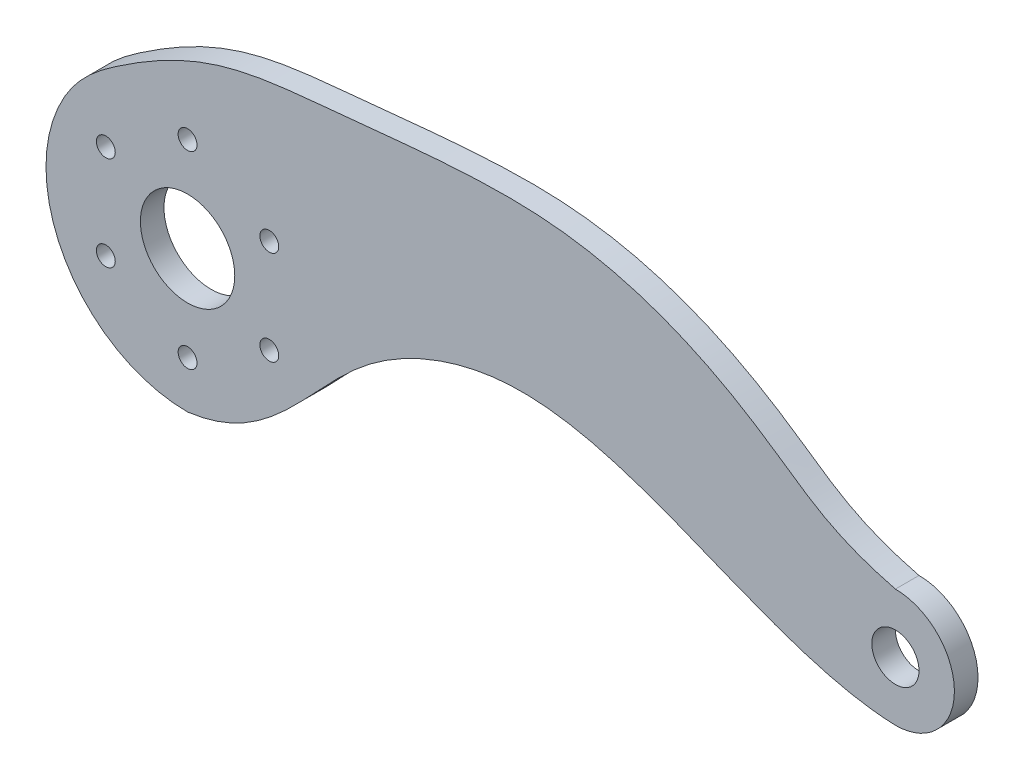
ISO-10303-21;
HEADER;
FILE_DESCRIPTION(('STEP AP214'),'2;1');
FILE_NAME('part.step','',(''),(''),'','','');
FILE_SCHEMA(('AUTOMOTIVE_DESIGN { 1 0 10303 214 1 1 1 1 }'));
ENDSEC;
DATA;
#1=APPLICATION_CONTEXT('core data for automotive mechanical design processes');
#2=APPLICATION_PROTOCOL_DEFINITION('international standard','automotive_design',2000,#1);
#3=PRODUCT_CONTEXT('',#1,'mechanical');
#4=PRODUCT('Part','Part','',(#3));
#5=PRODUCT_RELATED_PRODUCT_CATEGORY('part','',(#4));
#6=PRODUCT_DEFINITION_FORMATION('','',#4);
#7=PRODUCT_DEFINITION_CONTEXT('part definition',#1,'design');
#8=PRODUCT_DEFINITION('design','',#6,#7);
#9=PRODUCT_DEFINITION_SHAPE('','',#8);
#10=(LENGTH_UNIT() NAMED_UNIT(*) SI_UNIT(.MILLI.,.METRE.));
#11=(NAMED_UNIT(*) PLANE_ANGLE_UNIT() SI_UNIT($,.RADIAN.));
#12=(NAMED_UNIT(*) SI_UNIT($,.STERADIAN.) SOLID_ANGLE_UNIT());
#13=UNCERTAINTY_MEASURE_WITH_UNIT(LENGTH_MEASURE(1.E-05),#10,'distance_accuracy_value','');
#14=(GEOMETRIC_REPRESENTATION_CONTEXT(3) GLOBAL_UNCERTAINTY_ASSIGNED_CONTEXT((#13)) GLOBAL_UNIT_ASSIGNED_CONTEXT((#10,
#11,#12)) REPRESENTATION_CONTEXT('',''));
#15=CARTESIAN_POINT('',(0.,0.,0.));
#16=DIRECTION('',(0.,0.,1.));
#17=DIRECTION('',(1.,0.,0.));
#18=AXIS2_PLACEMENT_3D('',#15,#16,#17);
#19=CARTESIAN_POINT('',(150.,0.,5.));
#20=DIRECTION('',(0.,0.,-1.));
#21=DIRECTION('',(-1.,0.,0.));
#22=AXIS2_PLACEMENT_3D('',#19,#20,#21);
#23=CYLINDRICAL_SURFACE('',#22,12.5);
#24=CARTESIAN_POINT('',(150.,0.,0.));
#25=DIRECTION('',(0.,0.,1.));
#26=DIRECTION('',(1.,0.,0.));
#27=AXIS2_PLACEMENT_3D('',#24,#25,#26);
#28=CIRCLE('',#27,12.5);
#29=CARTESIAN_POINT('',(159.428456141883,-8.2069613609783,0.));
#30=VERTEX_POINT('',#29);
#31=CARTESIAN_POINT('',(150.,12.5,0.));
#32=VERTEX_POINT('',#31);
#33=EDGE_CURVE('E171',#30,#32,#28,.T.);
#34=ORIENTED_EDGE('',*,*,#33,.T.);
#35=DIRECTION('',(0.,0.,-1.));
#36=VECTOR('',#35,1.);
#37=CARTESIAN_POINT('',(150.,12.5,5.));
#38=LINE('',#37,#36);
#39=CARTESIAN_POINT('',(150.,12.5,5.));
#40=VERTEX_POINT('',#39);
#41=EDGE_CURVE('E11',#40,#32,#38,.T.);
#42=ORIENTED_EDGE('',*,*,#41,.F.);
#43=CARTESIAN_POINT('',(150.,0.,5.));
#44=DIRECTION('',(0.,0.,1.));
#45=DIRECTION('',(1.,0.,0.));
#46=AXIS2_PLACEMENT_3D('',#43,#44,#45);
#47=CIRCLE('',#46,12.5);
#48=CARTESIAN_POINT('',(159.428456141883,-8.2069613609783,5.));
#49=VERTEX_POINT('',#48);
#50=EDGE_CURVE('E87',#49,#40,#47,.T.);
#51=ORIENTED_EDGE('',*,*,#50,.F.);
#52=DIRECTION('',(0.,0.,-1.));
#53=VECTOR('',#52,1.);
#54=CARTESIAN_POINT('',(159.428456141883,-8.2069613609783,5.));
#55=LINE('',#54,#53);
#56=EDGE_CURVE('E152',#49,#30,#55,.T.);
#57=ORIENTED_EDGE('',*,*,#56,.T.);
#58=EDGE_LOOP('',(#34,#42,#51,#57));
#59=FACE_BOUND('',#58,.T.);
#60=ADVANCED_FACE('F36',(#59),#23,.T.);
#61=CARTESIAN_POINT('',(-26.0634616612886,14.8558394656963,5.));
#62=CARTESIAN_POINT('',(-22.9952074946197,20.2388624193786,5.));
#63=CARTESIAN_POINT('',(2.37328640151584,39.108047074936,5.));
#64=CARTESIAN_POINT('',(20.1597515349127,39.1077374338959,5.));
#65=CARTESIAN_POINT('',(86.7416157626449,46.9998153067509,5.));
#66=CARTESIAN_POINT('',(125.812924925436,25.830072721874,5.));
#67=CARTESIAN_POINT('',(135.882657692138,16.0754827587227,5.));
#68=CARTESIAN_POINT('',(150.,12.5,5.));
#69=B_SPLINE_CURVE_WITH_KNOTS('',3,(#61,#62,#63,#64,#65,#66,#67,#68),.UNSPECIFIED.,.F.,.F.,(4,1,
1,1,1,4),(0.,0.056043778506057,0.324796612619319,0.474987683898155,0.725167046493458,
0.945335070860267),.UNSPECIFIED.);
#70=DIRECTION('',(0.,0.,-1.));
#71=VECTOR('',#70,1.);
#72=SURFACE_OF_LINEAR_EXTRUSION('',#69,#71);
#73=CARTESIAN_POINT('',(-26.0634616612886,14.8558394656963,0.));
#74=CARTESIAN_POINT('',(-22.9952074946197,20.2388624193786,0.));
#75=CARTESIAN_POINT('',(2.37328640151584,39.108047074936,0.));
#76=CARTESIAN_POINT('',(20.1597515349127,39.1077374338959,0.));
#77=CARTESIAN_POINT('',(86.7416157626449,46.9998153067509,0.));
#78=CARTESIAN_POINT('',(125.812924925436,25.830072721874,0.));
#79=CARTESIAN_POINT('',(135.882657692138,16.0754827587227,0.));
#80=CARTESIAN_POINT('',(150.,12.5,0.));
#81=B_SPLINE_CURVE_WITH_KNOTS('',3,(#73,#74,#75,#76,#77,#78,#79,#80),.UNSPECIFIED.,.F.,.F.,(4,1,
1,1,1,4),(0.,0.056043778506057,0.324796612619319,0.474987683898155,0.725167046493458,
0.945335070860267),.UNSPECIFIED.);
#82=CARTESIAN_POINT('',(-26.0634616612886,14.8558394656963,0.));
#83=VERTEX_POINT('',#82);
#84=EDGE_CURVE('E167',#83,#32,#81,.T.);
#85=ORIENTED_EDGE('',*,*,#84,.F.);
#86=DIRECTION('',(0.,0.,-1.));
#87=VECTOR('',#86,1.);
#88=CARTESIAN_POINT('',(-26.0634616612886,14.8558394656963,5.));
#89=LINE('',#88,#87);
#90=CARTESIAN_POINT('',(-26.0634616612886,14.8558394656963,5.));
#91=VERTEX_POINT('',#90);
#92=EDGE_CURVE('E45',#91,#83,#89,.T.);
#93=ORIENTED_EDGE('',*,*,#92,.F.);
#94=EDGE_CURVE('E121',#91,#40,#69,.T.);
#95=ORIENTED_EDGE('',*,*,#94,.T.);
#96=ORIENTED_EDGE('',*,*,#41,.T.);
#97=EDGE_LOOP('',(#85,#93,#95,#96));
#98=FACE_BOUND('',#97,.T.);
#99=ADVANCED_FACE('F169',(#98),#72,.T.);
#100=CARTESIAN_POINT('',(0.,0.,5.));
#101=DIRECTION('',(0.,0.,-1.));
#102=DIRECTION('',(-1.,0.,0.));
#103=AXIS2_PLACEMENT_3D('',#100,#101,#102);
#104=CYLINDRICAL_SURFACE('',#103,30.);
#105=CARTESIAN_POINT('',(0.,0.,0.));
#106=DIRECTION('',(0.,0.,1.));
#107=DIRECTION('',(1.,0.,0.));
#108=AXIS2_PLACEMENT_3D('',#105,#106,#107);
#109=CIRCLE('',#108,30.);
#110=CARTESIAN_POINT('',(0.,-30.,0.));
#111=VERTEX_POINT('',#110);
#112=EDGE_CURVE('E159',#83,#111,#109,.T.);
#113=ORIENTED_EDGE('',*,*,#112,.T.);
#114=DIRECTION('',(0.,0.,-1.));
#115=VECTOR('',#114,1.);
#116=CARTESIAN_POINT('',(0.,-30.,5.));
#117=LINE('',#116,#115);
#118=CARTESIAN_POINT('',(0.,-30.,5.));
#119=VERTEX_POINT('',#118);
#120=EDGE_CURVE('E112',#119,#111,#117,.T.);
#121=ORIENTED_EDGE('',*,*,#120,.F.);
#122=CARTESIAN_POINT('',(0.,0.,5.));
#123=DIRECTION('',(0.,0.,1.));
#124=DIRECTION('',(1.,0.,0.));
#125=AXIS2_PLACEMENT_3D('',#122,#123,#124);
#126=CIRCLE('',#125,30.);
#127=EDGE_CURVE('E103',#91,#119,#126,.T.);
#128=ORIENTED_EDGE('',*,*,#127,.F.);
#129=ORIENTED_EDGE('',*,*,#92,.T.);
#130=EDGE_LOOP('',(#113,#121,#128,#129));
#131=FACE_BOUND('',#130,.T.);
#132=ADVANCED_FACE('F158',(#131),#104,.T.);
#133=CARTESIAN_POINT('',(0.,-30.,5.));
#134=CARTESIAN_POINT('',(17.9367533899456,-27.7458951634713,5.));
#135=CARTESIAN_POINT('',(30.1701670762407,-2.35203179127826,5.));
#136=CARTESIAN_POINT('',(85.2158700652859,19.6119948147056,5.));
#137=CARTESIAN_POINT('',(122.199362380188,-11.5342342503251,5.));
#138=CARTESIAN_POINT('',(150.,-12.5,5.));
#139=B_SPLINE_CURVE_WITH_KNOTS('',3,(#133,#134,#135,#136,#137,#138),.UNSPECIFIED.,.F.,.F.,(4,1,
1,4),(0.,0.288188907900472,0.475939829148129,1.),.UNSPECIFIED.);
#140=DIRECTION('',(0.,0.,-1.));
#141=VECTOR('',#140,1.);
#142=SURFACE_OF_LINEAR_EXTRUSION('',#139,#141);
#143=CARTESIAN_POINT('',(0.,-30.,0.));
#144=CARTESIAN_POINT('',(17.9367533899456,-27.7458951634713,0.));
#145=CARTESIAN_POINT('',(30.1701670762407,-2.35203179127826,0.));
#146=CARTESIAN_POINT('',(85.2158700652859,19.6119948147056,0.));
#147=CARTESIAN_POINT('',(122.199362380188,-11.5342342503251,0.));
#148=CARTESIAN_POINT('',(150.,-12.5,0.));
#149=B_SPLINE_CURVE_WITH_KNOTS('',3,(#143,#144,#145,#146,#147,#148),.UNSPECIFIED.,.F.,.F.,(4,1,
1,4),(0.,0.288188907900472,0.475939829148129,1.),.UNSPECIFIED.);
#150=CARTESIAN_POINT('',(150.,-12.5,0.));
#151=VERTEX_POINT('',#150);
#152=EDGE_CURVE('E111',#111,#151,#149,.T.);
#153=ORIENTED_EDGE('',*,*,#152,.T.);
#154=DIRECTION('',(0.,0.,-1.));
#155=VECTOR('',#154,1.);
#156=CARTESIAN_POINT('',(150.,-12.5,5.));
#157=LINE('',#156,#155);
#158=CARTESIAN_POINT('',(150.,-12.5,5.));
#159=VERTEX_POINT('',#158);
#160=EDGE_CURVE('E108',#159,#151,#157,.T.);
#161=ORIENTED_EDGE('',*,*,#160,.F.);
#162=EDGE_CURVE('E96',#119,#159,#139,.T.);
#163=ORIENTED_EDGE('',*,*,#162,.F.);
#164=ORIENTED_EDGE('',*,*,#120,.T.);
#165=EDGE_LOOP('',(#153,#161,#163,#164));
#166=FACE_BOUND('',#165,.T.);
#167=ADVANCED_FACE('F109',(#166),#142,.F.);
#168=CARTESIAN_POINT('',(157.604608426971,-9.92068196609678,0.));
#169=VERTEX_POINT('',#168);
#170=EDGE_CURVE('E75',#151,#169,#28,.T.);
#171=ORIENTED_EDGE('',*,*,#170,.T.);
#172=DIRECTION('',(0.,0.,-1.));
#173=VECTOR('',#172,1.);
#174=CARTESIAN_POINT('',(157.604608426971,-9.92068196609678,5.));
#175=LINE('',#174,#173);
#176=CARTESIAN_POINT('',(157.604608426971,-9.92068196609678,5.));
#177=VERTEX_POINT('',#176);
#178=EDGE_CURVE('E113',#177,#169,#175,.T.);
#179=ORIENTED_EDGE('',*,*,#178,.F.);
#180=EDGE_CURVE('E101',#159,#177,#47,.T.);
#181=ORIENTED_EDGE('',*,*,#180,.F.);
#182=ORIENTED_EDGE('',*,*,#160,.T.);
#183=EDGE_LOOP('',(#171,#179,#181,#182));
#184=FACE_BOUND('',#183,.T.);
#185=ADVANCED_FACE('F115',(#184),#23,.T.);
#186=CARTESIAN_POINT('',(150.,0.,5.));
#187=DIRECTION('',(0.,0.,-1.));
#188=DIRECTION('',(-1.,0.,0.));
#189=AXIS2_PLACEMENT_3D('',#186,#187,#188);
#190=CYLINDRICAL_SURFACE('',#189,4.99999999999999);
#191=CARTESIAN_POINT('',(150.,0.,5.));
#192=DIRECTION('',(0.,0.,1.));
#193=DIRECTION('',(1.,0.,0.));
#194=AXIS2_PLACEMENT_3D('',#191,#192,#193);
#195=CIRCLE('',#194,4.99999999999999);
#196=CARTESIAN_POINT('',(155.,0.,5.));
#197=VERTEX_POINT('',#196);
#198=EDGE_CURVE('E243',#197,#197,#195,.T.);
#199=ORIENTED_EDGE('',*,*,#198,.T.);
#200=EDGE_LOOP('',(#199));
#201=FACE_BOUND('',#200,.T.);
#202=CARTESIAN_POINT('',(150.,0.,0.));
#203=DIRECTION('',(0.,0.,1.));
#204=DIRECTION('',(1.,0.,0.));
#205=AXIS2_PLACEMENT_3D('',#202,#203,#204);
#206=CIRCLE('',#205,4.99999999999999);
#207=CARTESIAN_POINT('',(155.,0.,0.));
#208=VERTEX_POINT('',#207);
#209=EDGE_CURVE('E143',#208,#208,#206,.T.);
#210=ORIENTED_EDGE('',*,*,#209,.F.);
#211=EDGE_LOOP('',(#210));
#212=FACE_BOUND('',#211,.T.);
#213=ADVANCED_FACE('F200',(#201,#212),#190,.F.);
#214=CARTESIAN_POINT('',(-17.3205080756875,-10.0000000000007,5.));
#215=DIRECTION('',(0.,0.,-1.));
#216=DIRECTION('',(-1.,0.,0.));
#217=AXIS2_PLACEMENT_3D('',#214,#215,#216);
#218=CYLINDRICAL_SURFACE('',#217,2.);
#219=CARTESIAN_POINT('',(-17.3205080756875,-10.0000000000007,5.));
#220=DIRECTION('',(0.,0.,1.));
#221=DIRECTION('',(1.,0.,0.));
#222=AXIS2_PLACEMENT_3D('',#219,#220,#221);
#223=CIRCLE('',#222,2.);
#224=CARTESIAN_POINT('',(-15.3205080756875,-10.0000000000007,5.));
#225=VERTEX_POINT('',#224);
#226=EDGE_CURVE('E117',#225,#225,#223,.T.);
#227=ORIENTED_EDGE('',*,*,#226,.T.);
#228=EDGE_LOOP('',(#227));
#229=FACE_BOUND('',#228,.T.);
#230=CARTESIAN_POINT('',(-17.3205080756875,-10.0000000000007,0.));
#231=DIRECTION('',(0.,0.,1.));
#232=DIRECTION('',(1.,0.,0.));
#233=AXIS2_PLACEMENT_3D('',#230,#231,#232);
#234=CIRCLE('',#233,2.);
#235=CARTESIAN_POINT('',(-15.3205080756875,-10.0000000000007,0.));
#236=VERTEX_POINT('',#235);
#237=EDGE_CURVE('E148',#236,#236,#234,.T.);
#238=ORIENTED_EDGE('',*,*,#237,.F.);
#239=EDGE_LOOP('',(#238));
#240=FACE_BOUND('',#239,.T.);
#241=ADVANCED_FACE('F197',(#229,#240),#218,.F.);
#242=CARTESIAN_POINT('',(150.,-12.5,5.));
#243=CARTESIAN_POINT('',(154.881138688973,-13.047211763152,5.));
#244=CARTESIAN_POINT('',(159.428456141883,-8.20696136097829,5.));
#245=B_SPLINE_CURVE_WITH_KNOTS('',2,(#242,#243,#244),.UNSPECIFIED.,.F.,.F.,(3,3),
(0.955766329423218,1.),.UNSPECIFIED.);
#246=DIRECTION('',(0.,0.,-1.));
#247=VECTOR('',#246,1.);
#248=SURFACE_OF_LINEAR_EXTRUSION('',#245,#247);
#249=CARTESIAN_POINT('',(150.,-12.5,0.));
#250=CARTESIAN_POINT('',(154.881138688973,-13.047211763152,0.));
#251=CARTESIAN_POINT('',(159.428456141883,-8.20696136097829,0.));
#252=B_SPLINE_CURVE_WITH_KNOTS('',2,(#249,#250,#251),.UNSPECIFIED.,.F.,.F.,(3,3),
(0.955766329423218,1.),.UNSPECIFIED.);
#253=EDGE_CURVE('E81',#169,#30,#252,.T.);
#254=ORIENTED_EDGE('',*,*,#253,.T.);
#255=ORIENTED_EDGE('',*,*,#56,.F.);
#256=EDGE_CURVE('E53',#177,#49,#245,.T.);
#257=ORIENTED_EDGE('',*,*,#256,.F.);
#258=ORIENTED_EDGE('',*,*,#178,.T.);
#259=EDGE_LOOP('',(#254,#255,#257,#258));
#260=FACE_BOUND('',#259,.T.);
#261=ADVANCED_FACE('F199',(#260),#248,.F.);
#262=CARTESIAN_POINT('',(1.68815751063618E-12,-20.,5.));
#263=DIRECTION('',(0.,0.,-1.));
#264=DIRECTION('',(-1.,0.,0.));
#265=AXIS2_PLACEMENT_3D('',#262,#263,#264);
#266=CYLINDRICAL_SURFACE('',#265,2.);
#267=CARTESIAN_POINT('',(1.68815751063618E-12,-20.,5.));
#268=DIRECTION('',(0.,0.,1.));
#269=DIRECTION('',(1.,0.,0.));
#270=AXIS2_PLACEMENT_3D('',#267,#268,#269);
#271=CIRCLE('',#270,2.);
#272=CARTESIAN_POINT('',(2.00000000000169,-20.,5.));
#273=VERTEX_POINT('',#272);
#274=EDGE_CURVE('E122',#273,#273,#271,.T.);
#275=ORIENTED_EDGE('',*,*,#274,.T.);
#276=EDGE_LOOP('',(#275));
#277=FACE_BOUND('',#276,.T.);
#278=CARTESIAN_POINT('',(1.68815751063618E-12,-20.,0.));
#279=DIRECTION('',(0.,0.,1.));
#280=DIRECTION('',(1.,0.,0.));
#281=AXIS2_PLACEMENT_3D('',#278,#279,#280);
#282=CIRCLE('',#281,2.);
#283=CARTESIAN_POINT('',(2.00000000000169,-20.,0.));
#284=VERTEX_POINT('',#283);
#285=EDGE_CURVE('E173',#284,#284,#282,.T.);
#286=ORIENTED_EDGE('',*,*,#285,.F.);
#287=EDGE_LOOP('',(#286));
#288=FACE_BOUND('',#287,.T.);
#289=ADVANCED_FACE('F207',(#277,#288),#266,.F.);
#290=CARTESIAN_POINT('',(17.32050807569,-9.99999999999927,5.));
#291=DIRECTION('',(0.,0.,-1.));
#292=DIRECTION('',(-1.,0.,0.));
#293=AXIS2_PLACEMENT_3D('',#290,#291,#292);
#294=CYLINDRICAL_SURFACE('',#293,2.);
#295=CARTESIAN_POINT('',(17.32050807569,-9.99999999999927,5.));
#296=DIRECTION('',(0.,0.,1.));
#297=DIRECTION('',(1.,0.,0.));
#298=AXIS2_PLACEMENT_3D('',#295,#296,#297);
#299=CIRCLE('',#298,2.);
#300=CARTESIAN_POINT('',(19.32050807569,-9.99999999999927,5.));
#301=VERTEX_POINT('',#300);
#302=EDGE_CURVE('E125',#301,#301,#299,.T.);
#303=ORIENTED_EDGE('',*,*,#302,.T.);
#304=EDGE_LOOP('',(#303));
#305=FACE_BOUND('',#304,.T.);
#306=CARTESIAN_POINT('',(17.32050807569,-9.99999999999927,0.));
#307=DIRECTION('',(0.,0.,1.));
#308=DIRECTION('',(1.,0.,0.));
#309=AXIS2_PLACEMENT_3D('',#306,#307,#308);
#310=CIRCLE('',#309,2.);
#311=CARTESIAN_POINT('',(19.32050807569,-9.99999999999927,0.));
#312=VERTEX_POINT('',#311);
#313=EDGE_CURVE('E257',#312,#312,#310,.T.);
#314=ORIENTED_EDGE('',*,*,#313,.F.);
#315=EDGE_LOOP('',(#314));
#316=FACE_BOUND('',#315,.T.);
#317=ADVANCED_FACE('F264',(#305,#316),#294,.F.);
#318=CARTESIAN_POINT('',(17.3205080756892,10.0000000000007,5.));
#319=DIRECTION('',(0.,0.,-1.));
#320=DIRECTION('',(-1.,0.,0.));
#321=AXIS2_PLACEMENT_3D('',#318,#319,#320);
#322=CYLINDRICAL_SURFACE('',#321,2.00000000000001);
#323=CARTESIAN_POINT('',(17.3205080756892,10.0000000000007,5.));
#324=DIRECTION('',(0.,0.,1.));
#325=DIRECTION('',(1.,0.,0.));
#326=AXIS2_PLACEMENT_3D('',#323,#324,#325);
#327=CIRCLE('',#326,2.00000000000001);
#328=CARTESIAN_POINT('',(19.3205080756892,10.0000000000007,5.));
#329=VERTEX_POINT('',#328);
#330=EDGE_CURVE('E129',#329,#329,#327,.T.);
#331=ORIENTED_EDGE('',*,*,#330,.T.);
#332=EDGE_LOOP('',(#331));
#333=FACE_BOUND('',#332,.T.);
#334=CARTESIAN_POINT('',(17.3205080756892,10.0000000000007,0.));
#335=DIRECTION('',(0.,0.,1.));
#336=DIRECTION('',(1.,0.,0.));
#337=AXIS2_PLACEMENT_3D('',#334,#335,#336);
#338=CIRCLE('',#337,2.00000000000001);
#339=CARTESIAN_POINT('',(19.3205080756892,10.0000000000007,0.));
#340=VERTEX_POINT('',#339);
#341=EDGE_CURVE('E254',#340,#340,#338,.T.);
#342=ORIENTED_EDGE('',*,*,#341,.F.);
#343=EDGE_LOOP('',(#342));
#344=FACE_BOUND('',#343,.T.);
#345=ADVANCED_FACE('F269',(#333,#344),#322,.F.);
#346=CARTESIAN_POINT('',(0.,20.,5.));
#347=DIRECTION('',(0.,0.,-1.));
#348=DIRECTION('',(-1.,0.,0.));
#349=AXIS2_PLACEMENT_3D('',#346,#347,#348);
#350=CYLINDRICAL_SURFACE('',#349,2.);
#351=CARTESIAN_POINT('',(0.,20.,5.));
#352=DIRECTION('',(0.,0.,1.));
#353=DIRECTION('',(1.,0.,0.));
#354=AXIS2_PLACEMENT_3D('',#351,#352,#353);
#355=CIRCLE('',#354,2.);
#356=CARTESIAN_POINT('',(2.,20.,5.));
#357=VERTEX_POINT('',#356);
#358=EDGE_CURVE('E134',#357,#357,#355,.T.);
#359=ORIENTED_EDGE('',*,*,#358,.T.);
#360=EDGE_LOOP('',(#359));
#361=FACE_BOUND('',#360,.T.);
#362=CARTESIAN_POINT('',(0.,20.,0.));
#363=DIRECTION('',(0.,0.,1.));
#364=DIRECTION('',(1.,0.,0.));
#365=AXIS2_PLACEMENT_3D('',#362,#363,#364);
#366=CIRCLE('',#365,2.);
#367=CARTESIAN_POINT('',(2.,20.,0.));
#368=VERTEX_POINT('',#367);
#369=EDGE_CURVE('E251',#368,#368,#366,.T.);
#370=ORIENTED_EDGE('',*,*,#369,.F.);
#371=EDGE_LOOP('',(#370));
#372=FACE_BOUND('',#371,.T.);
#373=ADVANCED_FACE('F274',(#361,#372),#350,.F.);
#374=CARTESIAN_POINT('',(-17.3205080756884,9.99999999999926,5.));
#375=DIRECTION('',(0.,0.,-1.));
#376=DIRECTION('',(-1.,0.,0.));
#377=AXIS2_PLACEMENT_3D('',#374,#375,#376);
#378=CYLINDRICAL_SURFACE('',#377,2.);
#379=CARTESIAN_POINT('',(-17.3205080756884,9.99999999999926,5.));
#380=DIRECTION('',(0.,0.,1.));
#381=DIRECTION('',(1.,0.,0.));
#382=AXIS2_PLACEMENT_3D('',#379,#380,#381);
#383=CIRCLE('',#382,2.);
#384=CARTESIAN_POINT('',(-15.3205080756884,9.99999999999926,5.));
#385=VERTEX_POINT('',#384);
#386=EDGE_CURVE('E137',#385,#385,#383,.T.);
#387=ORIENTED_EDGE('',*,*,#386,.T.);
#388=EDGE_LOOP('',(#387));
#389=FACE_BOUND('',#388,.T.);
#390=CARTESIAN_POINT('',(-17.3205080756884,9.99999999999926,0.));
#391=DIRECTION('',(0.,0.,1.));
#392=DIRECTION('',(1.,0.,0.));
#393=AXIS2_PLACEMENT_3D('',#390,#391,#392);
#394=CIRCLE('',#393,2.);
#395=CARTESIAN_POINT('',(-15.3205080756884,9.99999999999926,0.));
#396=VERTEX_POINT('',#395);
#397=EDGE_CURVE('E248',#396,#396,#394,.T.);
#398=ORIENTED_EDGE('',*,*,#397,.F.);
#399=EDGE_LOOP('',(#398));
#400=FACE_BOUND('',#399,.T.);
#401=ADVANCED_FACE('F38',(#389,#400),#378,.F.);
#402=CARTESIAN_POINT('',(0.,0.,5.));
#403=DIRECTION('',(0.,0.,-1.));
#404=DIRECTION('',(-1.,0.,0.));
#405=AXIS2_PLACEMENT_3D('',#402,#403,#404);
#406=CYLINDRICAL_SURFACE('',#405,10.);
#407=CARTESIAN_POINT('',(0.,0.,5.));
#408=DIRECTION('',(0.,0.,1.));
#409=DIRECTION('',(1.,0.,0.));
#410=AXIS2_PLACEMENT_3D('',#407,#408,#409);
#411=CIRCLE('',#410,10.);
#412=CARTESIAN_POINT('',(10.,0.,5.));
#413=VERTEX_POINT('',#412);
#414=EDGE_CURVE('E154',#413,#413,#411,.T.);
#415=ORIENTED_EDGE('',*,*,#414,.T.);
#416=EDGE_LOOP('',(#415));
#417=FACE_BOUND('',#416,.T.);
#418=CARTESIAN_POINT('',(0.,0.,0.));
#419=DIRECTION('',(0.,0.,1.));
#420=DIRECTION('',(1.,0.,0.));
#421=AXIS2_PLACEMENT_3D('',#418,#419,#420);
#422=CIRCLE('',#421,10.);
#423=CARTESIAN_POINT('',(10.,0.,0.));
#424=VERTEX_POINT('',#423);
#425=EDGE_CURVE('E139',#424,#424,#422,.T.);
#426=ORIENTED_EDGE('',*,*,#425,.F.);
#427=EDGE_LOOP('',(#426));
#428=FACE_BOUND('',#427,.T.);
#429=ADVANCED_FACE('F281',(#417,#428),#406,.F.);
#430=CARTESIAN_POINT('',(0.,0.,5.));
#431=DIRECTION('',(0.,0.,1.));
#432=DIRECTION('',(1.,0.,0.));
#433=AXIS2_PLACEMENT_3D('',#430,#431,#432);
#434=PLANE('',#433);
#435=ORIENTED_EDGE('',*,*,#386,.F.);
#436=EDGE_LOOP('',(#435));
#437=FACE_BOUND('',#436,.T.);
#438=ORIENTED_EDGE('',*,*,#358,.F.);
#439=EDGE_LOOP('',(#438));
#440=FACE_BOUND('',#439,.T.);
#441=ORIENTED_EDGE('',*,*,#330,.F.);
#442=EDGE_LOOP('',(#441));
#443=FACE_BOUND('',#442,.T.);
#444=ORIENTED_EDGE('',*,*,#302,.F.);
#445=EDGE_LOOP('',(#444));
#446=FACE_BOUND('',#445,.T.);
#447=ORIENTED_EDGE('',*,*,#274,.F.);
#448=EDGE_LOOP('',(#447));
#449=FACE_BOUND('',#448,.T.);
#450=ORIENTED_EDGE('',*,*,#50,.T.);
#451=ORIENTED_EDGE('',*,*,#94,.F.);
#452=ORIENTED_EDGE('',*,*,#127,.T.);
#453=ORIENTED_EDGE('',*,*,#162,.T.);
#454=ORIENTED_EDGE('',*,*,#180,.T.);
#455=ORIENTED_EDGE('',*,*,#256,.T.);
#456=EDGE_LOOP('',(#450,#451,#452,#453,#454,#455));
#457=FACE_BOUND('',#456,.T.);
#458=ORIENTED_EDGE('',*,*,#226,.F.);
#459=EDGE_LOOP('',(#458));
#460=FACE_BOUND('',#459,.T.);
#461=ORIENTED_EDGE('',*,*,#198,.F.);
#462=EDGE_LOOP('',(#461));
#463=FACE_BOUND('',#462,.T.);
#464=ORIENTED_EDGE('',*,*,#414,.F.);
#465=EDGE_LOOP('',(#464));
#466=FACE_BOUND('',#465,.T.);
#467=ADVANCED_FACE('F98',(#437,#440,#443,#446,#449,#457,#460,#463,#466),#434,.T.);
#468=CARTESIAN_POINT('',(0.,0.,0.));
#469=DIRECTION('',(0.,0.,1.));
#470=DIRECTION('',(1.,0.,0.));
#471=AXIS2_PLACEMENT_3D('',#468,#469,#470);
#472=PLANE('',#471);
#473=ORIENTED_EDGE('',*,*,#397,.T.);
#474=EDGE_LOOP('',(#473));
#475=FACE_BOUND('',#474,.T.);
#476=ORIENTED_EDGE('',*,*,#369,.T.);
#477=EDGE_LOOP('',(#476));
#478=FACE_BOUND('',#477,.T.);
#479=ORIENTED_EDGE('',*,*,#341,.T.);
#480=EDGE_LOOP('',(#479));
#481=FACE_BOUND('',#480,.T.);
#482=ORIENTED_EDGE('',*,*,#313,.T.);
#483=EDGE_LOOP('',(#482));
#484=FACE_BOUND('',#483,.T.);
#485=ORIENTED_EDGE('',*,*,#285,.T.);
#486=EDGE_LOOP('',(#485));
#487=FACE_BOUND('',#486,.T.);
#488=ORIENTED_EDGE('',*,*,#33,.F.);
#489=ORIENTED_EDGE('',*,*,#253,.F.);
#490=ORIENTED_EDGE('',*,*,#170,.F.);
#491=ORIENTED_EDGE('',*,*,#152,.F.);
#492=ORIENTED_EDGE('',*,*,#112,.F.);
#493=ORIENTED_EDGE('',*,*,#84,.T.);
#494=EDGE_LOOP('',(#488,#489,#490,#491,#492,#493));
#495=FACE_BOUND('',#494,.T.);
#496=ORIENTED_EDGE('',*,*,#237,.T.);
#497=EDGE_LOOP('',(#496));
#498=FACE_BOUND('',#497,.T.);
#499=ORIENTED_EDGE('',*,*,#209,.T.);
#500=EDGE_LOOP('',(#499));
#501=FACE_BOUND('',#500,.T.);
#502=ORIENTED_EDGE('',*,*,#425,.T.);
#503=EDGE_LOOP('',(#502));
#504=FACE_BOUND('',#503,.T.);
#505=ADVANCED_FACE('F165',(#475,#478,#481,#484,#487,#495,#498,#501,#504),#472,.F.);
#506=CLOSED_SHELL('',(#60,#99,#132,#167,#185,#213,#241,#261,#289,#317,#345,#373,#401,#429,#467,#505));
#507=MANIFOLD_SOLID_BREP('B2',#506);
#508=ADVANCED_BREP_SHAPE_REPRESENTATION('',(#18,#507),#14);
#509=SHAPE_DEFINITION_REPRESENTATION(#9,#508);
ENDSEC;
END-ISO-10303-21;
